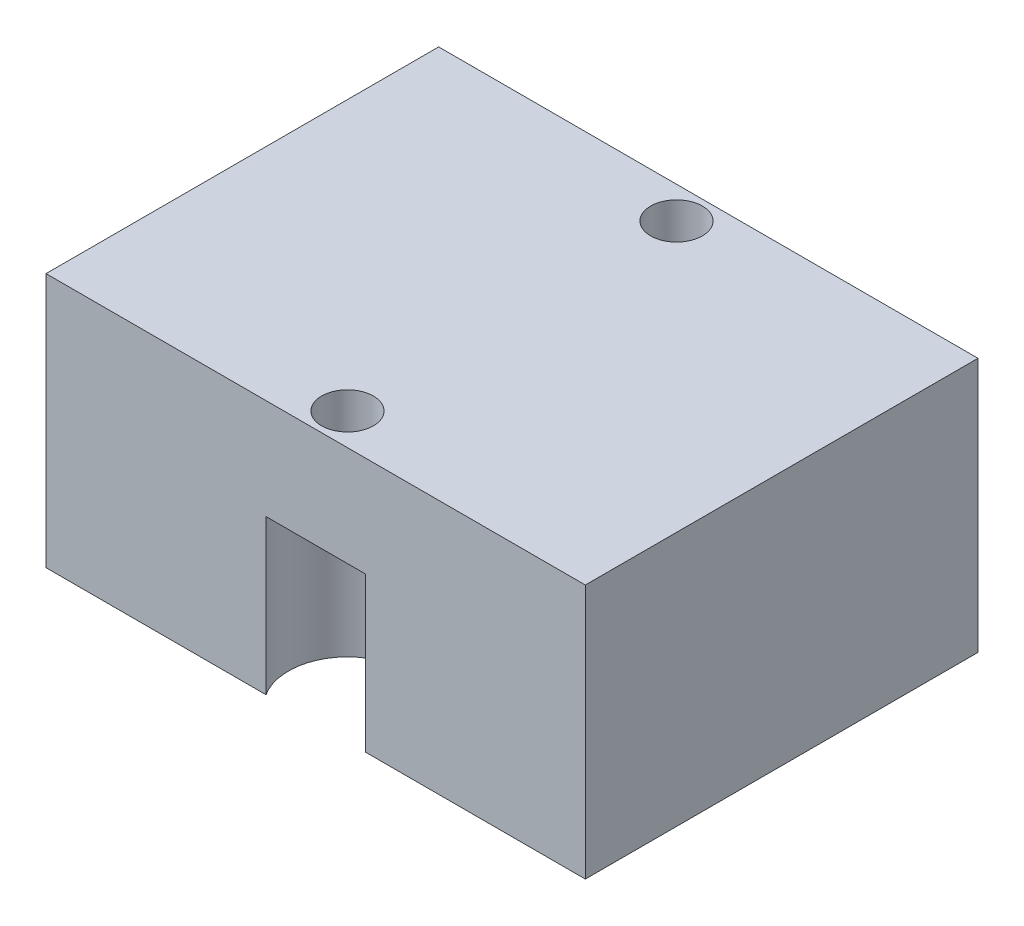
ISO-10303-21;
HEADER;
FILE_DESCRIPTION(('STEP AP214'),'2;1');
FILE_NAME('part.step','',(''),(''),'','','');
FILE_SCHEMA(('AUTOMOTIVE_DESIGN { 1 0 10303 214 1 1 1 1 }'));
ENDSEC;
DATA;
#1=APPLICATION_CONTEXT('core data for automotive mechanical design processes');
#2=APPLICATION_PROTOCOL_DEFINITION('international standard','automotive_design',2000,#1);
#3=PRODUCT_CONTEXT('',#1,'mechanical');
#4=PRODUCT('Part','Part','',(#3));
#5=PRODUCT_RELATED_PRODUCT_CATEGORY('part','',(#4));
#6=PRODUCT_DEFINITION_FORMATION('','',#4);
#7=PRODUCT_DEFINITION_CONTEXT('part definition',#1,'design');
#8=PRODUCT_DEFINITION('design','',#6,#7);
#9=PRODUCT_DEFINITION_SHAPE('','',#8);
#10=(LENGTH_UNIT() NAMED_UNIT(*) SI_UNIT(.MILLI.,.METRE.));
#11=(NAMED_UNIT(*) PLANE_ANGLE_UNIT() SI_UNIT($,.RADIAN.));
#12=(NAMED_UNIT(*) SI_UNIT($,.STERADIAN.) SOLID_ANGLE_UNIT());
#13=UNCERTAINTY_MEASURE_WITH_UNIT(LENGTH_MEASURE(1.E-05),#10,'distance_accuracy_value','');
#14=(GEOMETRIC_REPRESENTATION_CONTEXT(3) GLOBAL_UNCERTAINTY_ASSIGNED_CONTEXT((#13)) GLOBAL_UNIT_ASSIGNED_CONTEXT((#10,
#11,#12)) REPRESENTATION_CONTEXT('',''));
#15=CARTESIAN_POINT('',(0.,0.,0.));
#16=DIRECTION('',(0.,0.,1.));
#17=DIRECTION('',(1.,0.,0.));
#18=AXIS2_PLACEMENT_3D('',#15,#16,#17);
#19=CARTESIAN_POINT('',(0.,12.,0.));
#20=DIRECTION('',(1.,0.,0.));
#21=DIRECTION('',(0.,0.,-1.));
#22=AXIS2_PLACEMENT_3D('',#19,#20,#21);
#23=PLANE('',#22);
#24=DIRECTION('',(0.,0.,1.));
#25=VECTOR('',#24,1.);
#26=CARTESIAN_POINT('',(0.,0.,0.));
#27=LINE('',#26,#25);
#28=CARTESIAN_POINT('',(0.,0.,-18.5));
#29=VERTEX_POINT('',#28);
#30=CARTESIAN_POINT('',(0.,0.,0.));
#31=VERTEX_POINT('',#30);
#32=EDGE_CURVE('E200',#29,#31,#27,.T.);
#33=ORIENTED_EDGE('',*,*,#32,.T.);
#34=DIRECTION('',(0.,-1.,0.));
#35=VECTOR('',#34,1.);
#36=CARTESIAN_POINT('',(0.,12.,0.));
#37=LINE('',#36,#35);
#38=CARTESIAN_POINT('',(0.,12.,0.));
#39=VERTEX_POINT('',#38);
#40=EDGE_CURVE('E239',#39,#31,#37,.T.);
#41=ORIENTED_EDGE('',*,*,#40,.F.);
#42=DIRECTION('',(0.,0.,1.));
#43=VECTOR('',#42,1.);
#44=CARTESIAN_POINT('',(0.,12.,0.));
#45=LINE('',#44,#43);
#46=CARTESIAN_POINT('',(0.,12.,-18.5));
#47=VERTEX_POINT('',#46);
#48=EDGE_CURVE('E201',#47,#39,#45,.T.);
#49=ORIENTED_EDGE('',*,*,#48,.F.);
#50=DIRECTION('',(0.,-1.,0.));
#51=VECTOR('',#50,1.);
#52=CARTESIAN_POINT('',(0.,12.,-18.5));
#53=LINE('',#52,#51);
#54=EDGE_CURVE('E214',#47,#29,#53,.T.);
#55=ORIENTED_EDGE('',*,*,#54,.T.);
#56=EDGE_LOOP('',(#33,#41,#49,#55));
#57=FACE_BOUND('',#56,.T.);
#58=ADVANCED_FACE('F45',(#57),#23,.F.);
#59=CARTESIAN_POINT('',(0.,12.,0.));
#60=DIRECTION('',(0.,0.,-1.));
#61=DIRECTION('',(-1.,0.,0.));
#62=AXIS2_PLACEMENT_3D('',#59,#60,#61);
#63=PLANE('',#62);
#64=DIRECTION('',(1.,0.,0.));
#65=VECTOR('',#64,1.);
#66=CARTESIAN_POINT('',(0.,7.269988,0.));
#67=LINE('',#66,#65);
#68=CARTESIAN_POINT('',(10.3658747067333,7.269988,0.));
#69=VERTEX_POINT('',#68);
#70=CARTESIAN_POINT('',(15.0441252932667,7.269988,0.));
#71=VERTEX_POINT('',#70);
#72=EDGE_CURVE('E247',#69,#71,#67,.T.);
#73=ORIENTED_EDGE('',*,*,#72,.T.);
#74=DIRECTION('',(0.,-1.,0.));
#75=VECTOR('',#74,1.);
#76=CARTESIAN_POINT('',(15.0441252932667,0.,0.));
#77=LINE('',#76,#75);
#78=CARTESIAN_POINT('',(15.0441252932667,0.,0.));
#79=VERTEX_POINT('',#78);
#80=EDGE_CURVE('E53',#71,#79,#77,.T.);
#81=ORIENTED_EDGE('',*,*,#80,.T.);
#82=DIRECTION('',(1.,0.,0.));
#83=VECTOR('',#82,1.);
#84=CARTESIAN_POINT('',(0.,0.,0.));
#85=LINE('',#84,#83);
#86=CARTESIAN_POINT('',(25.41,0.,0.));
#87=VERTEX_POINT('',#86);
#88=EDGE_CURVE('E218',#79,#87,#85,.T.);
#89=ORIENTED_EDGE('',*,*,#88,.T.);
#90=DIRECTION('',(0.,-1.,0.));
#91=VECTOR('',#90,1.);
#92=CARTESIAN_POINT('',(25.41,12.,0.));
#93=LINE('',#92,#91);
#94=CARTESIAN_POINT('',(25.41,12.,0.));
#95=VERTEX_POINT('',#94);
#96=EDGE_CURVE('E235',#95,#87,#93,.T.);
#97=ORIENTED_EDGE('',*,*,#96,.F.);
#98=DIRECTION('',(1.,0.,0.));
#99=VECTOR('',#98,1.);
#100=CARTESIAN_POINT('',(0.,12.,0.));
#101=LINE('',#100,#99);
#102=EDGE_CURVE('E205',#39,#95,#101,.T.);
#103=ORIENTED_EDGE('',*,*,#102,.F.);
#104=ORIENTED_EDGE('',*,*,#40,.T.);
#105=CARTESIAN_POINT('',(10.3658747067333,0.,0.));
#106=VERTEX_POINT('',#105);
#107=EDGE_CURVE('E219',#31,#106,#85,.T.);
#108=ORIENTED_EDGE('',*,*,#107,.T.);
#109=DIRECTION('',(0.,-1.,0.));
#110=VECTOR('',#109,1.);
#111=CARTESIAN_POINT('',(10.3658747067333,0.,0.));
#112=LINE('',#111,#110);
#113=EDGE_CURVE('E243',#106,#69,#112,.F.);
#114=ORIENTED_EDGE('',*,*,#113,.T.);
#115=EDGE_LOOP('',(#73,#81,#89,#97,#103,#104,#108,#114));
#116=FACE_BOUND('',#115,.T.);
#117=ADVANCED_FACE('F254',(#116),#63,.F.);
#118=CARTESIAN_POINT('',(25.41,12.,0.));
#119=DIRECTION('',(-1.,0.,0.));
#120=DIRECTION('',(0.,0.,1.));
#121=AXIS2_PLACEMENT_3D('',#118,#119,#120);
#122=PLANE('',#121);
#123=DIRECTION('',(0.,0.,-1.));
#124=VECTOR('',#123,1.);
#125=CARTESIAN_POINT('',(25.41,0.,0.));
#126=LINE('',#125,#124);
#127=CARTESIAN_POINT('',(25.41,0.,-18.5));
#128=VERTEX_POINT('',#127);
#129=EDGE_CURVE('E223',#87,#128,#126,.T.);
#130=ORIENTED_EDGE('',*,*,#129,.T.);
#131=DIRECTION('',(0.,-1.,0.));
#132=VECTOR('',#131,1.);
#133=CARTESIAN_POINT('',(25.41,12.,-18.5));
#134=LINE('',#133,#132);
#135=CARTESIAN_POINT('',(25.41,12.,-18.5));
#136=VERTEX_POINT('',#135);
#137=EDGE_CURVE('E232',#136,#128,#134,.T.);
#138=ORIENTED_EDGE('',*,*,#137,.F.);
#139=DIRECTION('',(0.,0.,-1.));
#140=VECTOR('',#139,1.);
#141=CARTESIAN_POINT('',(25.41,12.,0.));
#142=LINE('',#141,#140);
#143=EDGE_CURVE('E208',#95,#136,#142,.T.);
#144=ORIENTED_EDGE('',*,*,#143,.F.);
#145=ORIENTED_EDGE('',*,*,#96,.T.);
#146=EDGE_LOOP('',(#130,#138,#144,#145));
#147=FACE_BOUND('',#146,.T.);
#148=ADVANCED_FACE('F299',(#147),#122,.F.);
#149=CARTESIAN_POINT('',(0.,12.,-18.5));
#150=DIRECTION('',(0.,0.,1.));
#151=DIRECTION('',(1.,0.,0.));
#152=AXIS2_PLACEMENT_3D('',#149,#150,#151);
#153=PLANE('',#152);
#154=DIRECTION('',(-1.,0.,0.));
#155=VECTOR('',#154,1.);
#156=CARTESIAN_POINT('',(0.,7.269988,-18.5));
#157=LINE('',#156,#155);
#158=CARTESIAN_POINT('',(15.0441252932667,7.269988,-18.5));
#159=VERTEX_POINT('',#158);
#160=CARTESIAN_POINT('',(10.3658747067333,7.269988,-18.5));
#161=VERTEX_POINT('',#160);
#162=EDGE_CURVE('E11',#159,#161,#157,.T.);
#163=ORIENTED_EDGE('',*,*,#162,.T.);
#164=DIRECTION('',(0.,-1.,0.));
#165=VECTOR('',#164,1.);
#166=CARTESIAN_POINT('',(10.3658747067333,0.,-18.5));
#167=LINE('',#166,#165);
#168=CARTESIAN_POINT('',(10.3658747067333,0.,-18.5));
#169=VERTEX_POINT('',#168);
#170=EDGE_CURVE('E127',#161,#169,#167,.T.);
#171=ORIENTED_EDGE('',*,*,#170,.T.);
#172=DIRECTION('',(-1.,0.,0.));
#173=VECTOR('',#172,1.);
#174=CARTESIAN_POINT('',(0.,0.,-18.5));
#175=LINE('',#174,#173);
#176=EDGE_CURVE('E226',#169,#29,#175,.T.);
#177=ORIENTED_EDGE('',*,*,#176,.T.);
#178=ORIENTED_EDGE('',*,*,#54,.F.);
#179=DIRECTION('',(-1.,0.,0.));
#180=VECTOR('',#179,1.);
#181=CARTESIAN_POINT('',(0.,12.,-18.5));
#182=LINE('',#181,#180);
#183=EDGE_CURVE('E211',#136,#47,#182,.T.);
#184=ORIENTED_EDGE('',*,*,#183,.F.);
#185=ORIENTED_EDGE('',*,*,#137,.T.);
#186=CARTESIAN_POINT('',(15.0441252932667,0.,-18.5));
#187=VERTEX_POINT('',#186);
#188=EDGE_CURVE('E136',#128,#187,#175,.T.);
#189=ORIENTED_EDGE('',*,*,#188,.T.);
#190=DIRECTION('',(0.,-1.,0.));
#191=VECTOR('',#190,1.);
#192=CARTESIAN_POINT('',(15.0441252932667,0.,-18.5));
#193=LINE('',#192,#191);
#194=EDGE_CURVE('E60',#187,#159,#193,.F.);
#195=ORIENTED_EDGE('',*,*,#194,.T.);
#196=EDGE_LOOP('',(#163,#171,#177,#178,#184,#185,#189,#195));
#197=FACE_BOUND('',#196,.T.);
#198=ADVANCED_FACE('F133',(#197),#153,.F.);
#199=CARTESIAN_POINT('',(0.,12.,0.));
#200=DIRECTION('',(0.,-1.,0.));
#201=DIRECTION('',(0.,0.,-1.));
#202=AXIS2_PLACEMENT_3D('',#199,#200,#201);
#203=PLANE('',#202);
#204=CARTESIAN_POINT('',(12.705,12.,-17.));
#205=DIRECTION('',(0.,-1.,0.));
#206=DIRECTION('',(0.,0.,-1.));
#207=AXIS2_PLACEMENT_3D('',#204,#205,#206);
#208=CIRCLE('',#207,1.2192);
#209=CARTESIAN_POINT('',(12.705,12.,-18.2192));
#210=VERTEX_POINT('',#209);
#211=EDGE_CURVE('E138',#210,#210,#208,.T.);
#212=ORIENTED_EDGE('',*,*,#211,.T.);
#213=EDGE_LOOP('',(#212));
#214=FACE_BOUND('',#213,.T.);
#215=CARTESIAN_POINT('',(12.705,12.,-1.5));
#216=DIRECTION('',(0.,-1.,0.));
#217=DIRECTION('',(0.,0.,-1.));
#218=AXIS2_PLACEMENT_3D('',#215,#216,#217);
#219=CIRCLE('',#218,1.2192);
#220=CARTESIAN_POINT('',(12.705,12.,-2.7192));
#221=VERTEX_POINT('',#220);
#222=EDGE_CURVE('E156',#221,#221,#219,.T.);
#223=ORIENTED_EDGE('',*,*,#222,.T.);
#224=EDGE_LOOP('',(#223));
#225=FACE_BOUND('',#224,.T.);
#226=ORIENTED_EDGE('',*,*,#48,.T.);
#227=ORIENTED_EDGE('',*,*,#102,.T.);
#228=ORIENTED_EDGE('',*,*,#143,.T.);
#229=ORIENTED_EDGE('',*,*,#183,.T.);
#230=EDGE_LOOP('',(#226,#227,#228,#229));
#231=FACE_BOUND('',#230,.T.);
#232=ADVANCED_FACE('F272',(#214,#225,#231),#203,.F.);
#233=CARTESIAN_POINT('',(0.,0.,0.));
#234=DIRECTION('',(0.,-1.,0.));
#235=DIRECTION('',(0.,0.,-1.));
#236=AXIS2_PLACEMENT_3D('',#233,#234,#235);
#237=PLANE('',#236);
#238=CARTESIAN_POINT('',(12.705,0.,-17.));
#239=DIRECTION('',(0.,-1.,0.));
#240=DIRECTION('',(0.,0.,-1.));
#241=AXIS2_PLACEMENT_3D('',#238,#239,#240);
#242=CIRCLE('',#241,2.77875999999999);
#243=EDGE_CURVE('E130',#187,#169,#242,.T.);
#244=ORIENTED_EDGE('',*,*,#243,.F.);
#245=ORIENTED_EDGE('',*,*,#188,.F.);
#246=ORIENTED_EDGE('',*,*,#129,.F.);
#247=ORIENTED_EDGE('',*,*,#88,.F.);
#248=CARTESIAN_POINT('',(12.705,0.,-1.5));
#249=DIRECTION('',(0.,-1.,0.));
#250=DIRECTION('',(0.,0.,-1.));
#251=AXIS2_PLACEMENT_3D('',#248,#249,#250);
#252=CIRCLE('',#251,2.77875999999999);
#253=EDGE_CURVE('E142',#106,#79,#252,.T.);
#254=ORIENTED_EDGE('',*,*,#253,.F.);
#255=ORIENTED_EDGE('',*,*,#107,.F.);
#256=ORIENTED_EDGE('',*,*,#32,.F.);
#257=ORIENTED_EDGE('',*,*,#176,.F.);
#258=EDGE_LOOP('',(#244,#245,#246,#247,#254,#255,#256,#257));
#259=FACE_BOUND('',#258,.T.);
#260=CARTESIAN_POINT('',(12.705,0.,-9.25));
#261=DIRECTION('',(0.,-1.,0.));
#262=DIRECTION('',(0.,0.,-1.));
#263=AXIS2_PLACEMENT_3D('',#260,#261,#262);
#264=CIRCLE('',#263,3.);
#265=CARTESIAN_POINT('',(12.705,0.,-12.25));
#266=VERTEX_POINT('',#265);
#267=EDGE_CURVE('E160',#266,#266,#264,.T.);
#268=ORIENTED_EDGE('',*,*,#267,.F.);
#269=EDGE_LOOP('',(#268));
#270=FACE_BOUND('',#269,.T.);
#271=CARTESIAN_POINT('',(23.91,0.,-17.));
#272=DIRECTION('',(0.,-1.,0.));
#273=DIRECTION('',(0.,0.,-1.));
#274=AXIS2_PLACEMENT_3D('',#271,#272,#273);
#275=CIRCLE('',#274,0.88899999999999);
#276=CARTESIAN_POINT('',(23.91,0.,-17.889));
#277=VERTEX_POINT('',#276);
#278=EDGE_CURVE('E165',#277,#277,#275,.T.);
#279=ORIENTED_EDGE('',*,*,#278,.F.);
#280=EDGE_LOOP('',(#279));
#281=FACE_BOUND('',#280,.T.);
#282=CARTESIAN_POINT('',(23.91,0.,-1.5));
#283=DIRECTION('',(0.,-1.,0.));
#284=DIRECTION('',(0.,0.,-1.));
#285=AXIS2_PLACEMENT_3D('',#282,#283,#284);
#286=CIRCLE('',#285,0.88899999999999);
#287=CARTESIAN_POINT('',(23.91,0.,-2.38899999999999));
#288=VERTEX_POINT('',#287);
#289=EDGE_CURVE('E176',#288,#288,#286,.T.);
#290=ORIENTED_EDGE('',*,*,#289,.F.);
#291=EDGE_LOOP('',(#290));
#292=FACE_BOUND('',#291,.T.);
#293=CARTESIAN_POINT('',(1.5,0.,-1.5));
#294=DIRECTION('',(0.,-1.,0.));
#295=DIRECTION('',(0.,0.,-1.));
#296=AXIS2_PLACEMENT_3D('',#293,#294,#295);
#297=CIRCLE('',#296,0.888999999999989);
#298=CARTESIAN_POINT('',(1.5,0.,-2.38899999999999));
#299=VERTEX_POINT('',#298);
#300=EDGE_CURVE('E184',#299,#299,#297,.T.);
#301=ORIENTED_EDGE('',*,*,#300,.F.);
#302=EDGE_LOOP('',(#301));
#303=FACE_BOUND('',#302,.T.);
#304=CARTESIAN_POINT('',(1.5,0.,-17.));
#305=DIRECTION('',(0.,-1.,0.));
#306=DIRECTION('',(0.,0.,-1.));
#307=AXIS2_PLACEMENT_3D('',#304,#305,#306);
#308=CIRCLE('',#307,0.888999999999989);
#309=CARTESIAN_POINT('',(1.5,0.,-17.889));
#310=VERTEX_POINT('',#309);
#311=EDGE_CURVE('E192',#310,#310,#308,.T.);
#312=ORIENTED_EDGE('',*,*,#311,.F.);
#313=EDGE_LOOP('',(#312));
#314=FACE_BOUND('',#313,.T.);
#315=ADVANCED_FACE('F259',(#259,#270,#281,#292,#303,#314),#237,.T.);
#316=CARTESIAN_POINT('',(1.5,7.4658349096845,-17.));
#317=DIRECTION('',(0.,-1.,0.));
#318=DIRECTION('',(0.,0.,-1.));
#319=AXIS2_PLACEMENT_3D('',#316,#317,#318);
#320=CONICAL_SURFACE('',#319,0.888999999999999,1.02974425867665);
#321=CARTESIAN_POINT('',(1.5,8.,-17.));
#322=VERTEX_POINT('',#321);
#323=VERTEX_LOOP('',#322);
#324=FACE_BOUND('',#323,.T.);
#325=CARTESIAN_POINT('',(1.5,7.4658349096845,-17.));
#326=DIRECTION('',(0.,-1.,0.));
#327=DIRECTION('',(0.,0.,-1.));
#328=AXIS2_PLACEMENT_3D('',#325,#326,#327);
#329=CIRCLE('',#328,0.888999999999999);
#330=CARTESIAN_POINT('',(1.5,7.4658349096845,-17.889));
#331=VERTEX_POINT('',#330);
#332=EDGE_CURVE('E196',#331,#331,#329,.T.);
#333=ORIENTED_EDGE('',*,*,#332,.T.);
#334=EDGE_LOOP('',(#333));
#335=FACE_BOUND('',#334,.T.);
#336=ADVANCED_FACE('F309',(#324,#335),#320,.F.);
#337=CARTESIAN_POINT('',(1.5,0.,-17.));
#338=DIRECTION('',(0.,-1.,0.));
#339=DIRECTION('',(0.,0.,-1.));
#340=AXIS2_PLACEMENT_3D('',#337,#338,#339);
#341=CYLINDRICAL_SURFACE('',#340,0.888999999999994);
#342=ORIENTED_EDGE('',*,*,#332,.F.);
#343=EDGE_LOOP('',(#342));
#344=FACE_BOUND('',#343,.T.);
#345=ORIENTED_EDGE('',*,*,#311,.T.);
#346=EDGE_LOOP('',(#345));
#347=FACE_BOUND('',#346,.T.);
#348=ADVANCED_FACE('F315',(#344,#347),#341,.F.);
#349=CARTESIAN_POINT('',(1.5,7.4658349096845,-1.5));
#350=DIRECTION('',(0.,-1.,0.));
#351=DIRECTION('',(0.,0.,-1.));
#352=AXIS2_PLACEMENT_3D('',#349,#350,#351);
#353=CONICAL_SURFACE('',#352,0.888999999999998,1.02974425867665);
#354=CARTESIAN_POINT('',(1.5,8.,-1.5));
#355=VERTEX_POINT('',#354);
#356=VERTEX_LOOP('',#355);
#357=FACE_BOUND('',#356,.T.);
#358=CARTESIAN_POINT('',(1.5,7.4658349096845,-1.5));
#359=DIRECTION('',(0.,-1.,0.));
#360=DIRECTION('',(0.,0.,-1.));
#361=AXIS2_PLACEMENT_3D('',#358,#359,#360);
#362=CIRCLE('',#361,0.888999999999998);
#363=CARTESIAN_POINT('',(1.5,7.4658349096845,-2.389));
#364=VERTEX_POINT('',#363);
#365=EDGE_CURVE('E188',#364,#364,#362,.T.);
#366=ORIENTED_EDGE('',*,*,#365,.T.);
#367=EDGE_LOOP('',(#366));
#368=FACE_BOUND('',#367,.T.);
#369=ADVANCED_FACE('F319',(#357,#368),#353,.F.);
#370=CARTESIAN_POINT('',(1.5,0.,-1.5));
#371=DIRECTION('',(0.,-1.,0.));
#372=DIRECTION('',(0.,0.,-1.));
#373=AXIS2_PLACEMENT_3D('',#370,#371,#372);
#374=CYLINDRICAL_SURFACE('',#373,0.888999999999994);
#375=ORIENTED_EDGE('',*,*,#365,.F.);
#376=EDGE_LOOP('',(#375));
#377=FACE_BOUND('',#376,.T.);
#378=ORIENTED_EDGE('',*,*,#300,.T.);
#379=EDGE_LOOP('',(#378));
#380=FACE_BOUND('',#379,.T.);
#381=ADVANCED_FACE('F323',(#377,#380),#374,.F.);
#382=CARTESIAN_POINT('',(23.91,7.4658349096845,-1.5));
#383=DIRECTION('',(0.,-1.,0.));
#384=DIRECTION('',(0.,0.,-1.));
#385=AXIS2_PLACEMENT_3D('',#382,#383,#384);
#386=CONICAL_SURFACE('',#385,0.888999999999997,1.02974425867665);
#387=CARTESIAN_POINT('',(23.91,8.,-1.5));
#388=VERTEX_POINT('',#387);
#389=VERTEX_LOOP('',#388);
#390=FACE_BOUND('',#389,.T.);
#391=CARTESIAN_POINT('',(23.91,7.4658349096845,-1.5));
#392=DIRECTION('',(0.,-1.,0.));
#393=DIRECTION('',(0.,0.,-1.));
#394=AXIS2_PLACEMENT_3D('',#391,#392,#393);
#395=CIRCLE('',#394,0.888999999999997);
#396=CARTESIAN_POINT('',(23.91,7.4658349096845,-2.389));
#397=VERTEX_POINT('',#396);
#398=EDGE_CURVE('E180',#397,#397,#395,.T.);
#399=ORIENTED_EDGE('',*,*,#398,.T.);
#400=EDGE_LOOP('',(#399));
#401=FACE_BOUND('',#400,.T.);
#402=ADVANCED_FACE('F327',(#390,#401),#386,.F.);
#403=CARTESIAN_POINT('',(23.91,0.,-1.5));
#404=DIRECTION('',(0.,-1.,0.));
#405=DIRECTION('',(0.,0.,-1.));
#406=AXIS2_PLACEMENT_3D('',#403,#404,#405);
#407=CYLINDRICAL_SURFACE('',#406,0.888999999999994);
#408=ORIENTED_EDGE('',*,*,#398,.F.);
#409=EDGE_LOOP('',(#408));
#410=FACE_BOUND('',#409,.T.);
#411=ORIENTED_EDGE('',*,*,#289,.T.);
#412=EDGE_LOOP('',(#411));
#413=FACE_BOUND('',#412,.T.);
#414=ADVANCED_FACE('F331',(#410,#413),#407,.F.);
#415=CARTESIAN_POINT('',(23.91,7.4658349096845,-17.));
#416=DIRECTION('',(0.,-1.,0.));
#417=DIRECTION('',(0.,0.,-1.));
#418=AXIS2_PLACEMENT_3D('',#415,#416,#417);
#419=CONICAL_SURFACE('',#418,0.888999999999997,1.02974425867665);
#420=CARTESIAN_POINT('',(23.91,8.,-17.));
#421=VERTEX_POINT('',#420);
#422=VERTEX_LOOP('',#421);
#423=FACE_BOUND('',#422,.T.);
#424=CARTESIAN_POINT('',(23.91,7.4658349096845,-17.));
#425=DIRECTION('',(0.,-1.,0.));
#426=DIRECTION('',(0.,0.,-1.));
#427=AXIS2_PLACEMENT_3D('',#424,#425,#426);
#428=CIRCLE('',#427,0.888999999999997);
#429=CARTESIAN_POINT('',(23.91,7.4658349096845,-17.889));
#430=VERTEX_POINT('',#429);
#431=EDGE_CURVE('E172',#430,#430,#428,.T.);
#432=ORIENTED_EDGE('',*,*,#431,.T.);
#433=EDGE_LOOP('',(#432));
#434=FACE_BOUND('',#433,.T.);
#435=ADVANCED_FACE('F335',(#423,#434),#419,.F.);
#436=CARTESIAN_POINT('',(23.91,0.,-17.));
#437=DIRECTION('',(0.,-1.,0.));
#438=DIRECTION('',(0.,0.,-1.));
#439=AXIS2_PLACEMENT_3D('',#436,#437,#438);
#440=CYLINDRICAL_SURFACE('',#439,0.888999999999994);
#441=ORIENTED_EDGE('',*,*,#431,.F.);
#442=EDGE_LOOP('',(#441));
#443=FACE_BOUND('',#442,.T.);
#444=ORIENTED_EDGE('',*,*,#278,.T.);
#445=EDGE_LOOP('',(#444));
#446=FACE_BOUND('',#445,.T.);
#447=ADVANCED_FACE('F339',(#443,#446),#440,.F.);
#448=CARTESIAN_POINT('',(12.705,3.,-9.25));
#449=DIRECTION('',(0.,-1.,0.));
#450=DIRECTION('',(0.,0.,-1.));
#451=AXIS2_PLACEMENT_3D('',#448,#449,#450);
#452=CYLINDRICAL_SURFACE('',#451,3.);
#453=CARTESIAN_POINT('',(12.705,3.,-9.25));
#454=DIRECTION('',(0.,-1.,0.));
#455=DIRECTION('',(0.,0.,-1.));
#456=AXIS2_PLACEMENT_3D('',#453,#454,#455);
#457=CIRCLE('',#456,3.);
#458=CARTESIAN_POINT('',(12.705,3.,-12.25));
#459=VERTEX_POINT('',#458);
#460=EDGE_CURVE('E161',#459,#459,#457,.T.);
#461=ORIENTED_EDGE('',*,*,#460,.F.);
#462=EDGE_LOOP('',(#461));
#463=FACE_BOUND('',#462,.T.);
#464=ORIENTED_EDGE('',*,*,#267,.T.);
#465=EDGE_LOOP('',(#464));
#466=FACE_BOUND('',#465,.T.);
#467=ADVANCED_FACE('F343',(#463,#466),#452,.F.);
#468=CARTESIAN_POINT('',(12.705,3.,-9.25));
#469=DIRECTION('',(0.,-1.,0.));
#470=DIRECTION('',(0.,0.,-1.));
#471=AXIS2_PLACEMENT_3D('',#468,#469,#470);
#472=PLANE('',#471);
#473=ORIENTED_EDGE('',*,*,#460,.T.);
#474=EDGE_LOOP('',(#473));
#475=FACE_BOUND('',#474,.T.);
#476=ADVANCED_FACE('F347',(#475),#472,.T.);
#477=CARTESIAN_POINT('',(13.9242,7.269988,-1.5));
#478=DIRECTION('',(0.,1.,0.));
#479=DIRECTION('',(0.,0.,1.));
#480=AXIS2_PLACEMENT_3D('',#477,#478,#479);
#481=PLANE('',#480);
#482=CARTESIAN_POINT('',(12.705,7.269988,-1.5));
#483=DIRECTION('',(0.,-1.,0.));
#484=DIRECTION('',(0.,0.,-1.));
#485=AXIS2_PLACEMENT_3D('',#482,#483,#484);
#486=CIRCLE('',#485,1.2192);
#487=CARTESIAN_POINT('',(12.705,7.269988,-2.7192));
#488=VERTEX_POINT('',#487);
#489=EDGE_CURVE('E152',#488,#488,#486,.T.);
#490=ORIENTED_EDGE('',*,*,#489,.F.);
#491=EDGE_LOOP('',(#490));
#492=FACE_BOUND('',#491,.T.);
#493=CARTESIAN_POINT('',(12.705,7.269988,-1.5));
#494=DIRECTION('',(0.,-1.,0.));
#495=DIRECTION('',(0.,0.,-1.));
#496=AXIS2_PLACEMENT_3D('',#493,#494,#495);
#497=CIRCLE('',#496,2.77875999999999);
#498=EDGE_CURVE('E68',#69,#71,#497,.T.);
#499=ORIENTED_EDGE('',*,*,#498,.T.);
#500=ORIENTED_EDGE('',*,*,#72,.F.);
#501=EDGE_LOOP('',(#499,#500));
#502=FACE_BOUND('',#501,.T.);
#503=ADVANCED_FACE('F350',(#492,#502),#481,.F.);
#504=CARTESIAN_POINT('',(12.705,0.,-1.5));
#505=DIRECTION('',(0.,-1.,0.));
#506=DIRECTION('',(0.,0.,-1.));
#507=AXIS2_PLACEMENT_3D('',#504,#505,#506);
#508=CYLINDRICAL_SURFACE('',#507,2.77875999999999);
#509=ORIENTED_EDGE('',*,*,#498,.F.);
#510=ORIENTED_EDGE('',*,*,#113,.F.);
#511=ORIENTED_EDGE('',*,*,#253,.T.);
#512=ORIENTED_EDGE('',*,*,#80,.F.);
#513=EDGE_LOOP('',(#509,#510,#511,#512));
#514=FACE_BOUND('',#513,.T.);
#515=ADVANCED_FACE('F291',(#514),#508,.F.);
#516=CARTESIAN_POINT('',(12.705,0.,-1.5));
#517=DIRECTION('',(0.,-1.,0.));
#518=DIRECTION('',(0.,0.,-1.));
#519=AXIS2_PLACEMENT_3D('',#516,#517,#518);
#520=CYLINDRICAL_SURFACE('',#519,1.2192);
#521=ORIENTED_EDGE('',*,*,#222,.F.);
#522=EDGE_LOOP('',(#521));
#523=FACE_BOUND('',#522,.T.);
#524=ORIENTED_EDGE('',*,*,#489,.T.);
#525=EDGE_LOOP('',(#524));
#526=FACE_BOUND('',#525,.T.);
#527=ADVANCED_FACE('F284',(#523,#526),#520,.F.);
#528=CARTESIAN_POINT('',(13.9242,7.269988,-17.));
#529=DIRECTION('',(0.,1.,0.));
#530=DIRECTION('',(0.,0.,1.));
#531=AXIS2_PLACEMENT_3D('',#528,#529,#530);
#532=PLANE('',#531);
#533=CARTESIAN_POINT('',(12.705,7.269988,-17.));
#534=DIRECTION('',(0.,-1.,0.));
#535=DIRECTION('',(0.,0.,-1.));
#536=AXIS2_PLACEMENT_3D('',#533,#534,#535);
#537=CIRCLE('',#536,1.2192);
#538=CARTESIAN_POINT('',(12.705,7.269988,-18.2192));
#539=VERTEX_POINT('',#538);
#540=EDGE_CURVE('E129',#539,#539,#537,.T.);
#541=ORIENTED_EDGE('',*,*,#540,.F.);
#542=EDGE_LOOP('',(#541));
#543=FACE_BOUND('',#542,.T.);
#544=CARTESIAN_POINT('',(12.705,7.269988,-17.));
#545=DIRECTION('',(0.,-1.,0.));
#546=DIRECTION('',(0.,0.,-1.));
#547=AXIS2_PLACEMENT_3D('',#544,#545,#546);
#548=CIRCLE('',#547,2.77875999999999);
#549=EDGE_CURVE('E123',#159,#161,#548,.T.);
#550=ORIENTED_EDGE('',*,*,#549,.T.);
#551=ORIENTED_EDGE('',*,*,#162,.F.);
#552=EDGE_LOOP('',(#550,#551));
#553=FACE_BOUND('',#552,.T.);
#554=ADVANCED_FACE('F122',(#543,#553),#532,.F.);
#555=CARTESIAN_POINT('',(12.705,0.,-17.));
#556=DIRECTION('',(0.,-1.,0.));
#557=DIRECTION('',(0.,0.,-1.));
#558=AXIS2_PLACEMENT_3D('',#555,#556,#557);
#559=CYLINDRICAL_SURFACE('',#558,2.77875999999999);
#560=ORIENTED_EDGE('',*,*,#549,.F.);
#561=ORIENTED_EDGE('',*,*,#194,.F.);
#562=ORIENTED_EDGE('',*,*,#243,.T.);
#563=ORIENTED_EDGE('',*,*,#170,.F.);
#564=EDGE_LOOP('',(#560,#561,#562,#563));
#565=FACE_BOUND('',#564,.T.);
#566=ADVANCED_FACE('F126',(#565),#559,.F.);
#567=CARTESIAN_POINT('',(12.705,0.,-17.));
#568=DIRECTION('',(0.,-1.,0.));
#569=DIRECTION('',(0.,0.,-1.));
#570=AXIS2_PLACEMENT_3D('',#567,#568,#569);
#571=CYLINDRICAL_SURFACE('',#570,1.2192);
#572=ORIENTED_EDGE('',*,*,#211,.F.);
#573=EDGE_LOOP('',(#572));
#574=FACE_BOUND('',#573,.T.);
#575=ORIENTED_EDGE('',*,*,#540,.T.);
#576=EDGE_LOOP('',(#575));
#577=FACE_BOUND('',#576,.T.);
#578=ADVANCED_FACE('F281',(#574,#577),#571,.F.);
#579=CLOSED_SHELL('',(#58,#117,#148,#198,#232,#315,#336,#348,#369,#381,#402,#414,#435,#447,#467,
#476,#503,#515,#527,#554,#566,#578));
#580=MANIFOLD_SOLID_BREP('B2',#579);
#581=ADVANCED_BREP_SHAPE_REPRESENTATION('',(#18,#580),#14);
#582=SHAPE_DEFINITION_REPRESENTATION(#9,#581);
ENDSEC;
END-ISO-10303-21;
